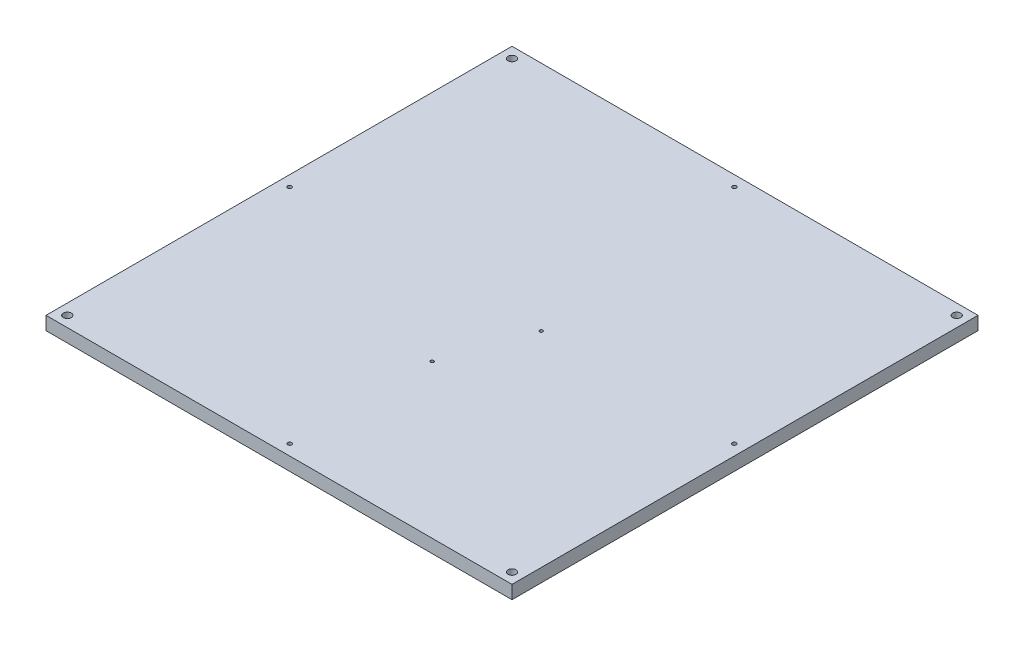
ISO-10303-21;
HEADER;
FILE_DESCRIPTION(('STEP AP214'),'2;1');
FILE_NAME('part.step','',(''),(''),'','','');
FILE_SCHEMA(('AUTOMOTIVE_DESIGN { 1 0 10303 214 1 1 1 1 }'));
ENDSEC;
DATA;
#1=APPLICATION_CONTEXT('core data for automotive mechanical design processes');
#2=APPLICATION_PROTOCOL_DEFINITION('international standard','automotive_design',2000,#1);
#3=PRODUCT_CONTEXT('',#1,'mechanical');
#4=PRODUCT('Part','Part','',(#3));
#5=PRODUCT_RELATED_PRODUCT_CATEGORY('part','',(#4));
#6=PRODUCT_DEFINITION_FORMATION('','',#4);
#7=PRODUCT_DEFINITION_CONTEXT('part definition',#1,'design');
#8=PRODUCT_DEFINITION('design','',#6,#7);
#9=PRODUCT_DEFINITION_SHAPE('','',#8);
#10=(LENGTH_UNIT() NAMED_UNIT(*) SI_UNIT(.MILLI.,.METRE.));
#11=(NAMED_UNIT(*) PLANE_ANGLE_UNIT() SI_UNIT($,.RADIAN.));
#12=(NAMED_UNIT(*) SI_UNIT($,.STERADIAN.) SOLID_ANGLE_UNIT());
#13=UNCERTAINTY_MEASURE_WITH_UNIT(LENGTH_MEASURE(1.E-05),#10,'distance_accuracy_value','');
#14=(GEOMETRIC_REPRESENTATION_CONTEXT(3) GLOBAL_UNCERTAINTY_ASSIGNED_CONTEXT((#13)) GLOBAL_UNIT_ASSIGNED_CONTEXT((#10,
#11,#12)) REPRESENTATION_CONTEXT('',''));
#15=CARTESIAN_POINT('',(0.,0.,0.));
#16=DIRECTION('',(0.,0.,1.));
#17=DIRECTION('',(1.,0.,0.));
#18=AXIS2_PLACEMENT_3D('',#15,#16,#17);
#19=CARTESIAN_POINT('',(0.,-50.,0.));
#20=DIRECTION('',(0.,-1.,0.));
#21=DIRECTION('',(0.,0.,-1.));
#22=AXIS2_PLACEMENT_3D('',#19,#20,#21);
#23=PLANE('',#22);
#24=DIRECTION('',(-1.,0.,0.));
#25=VECTOR('',#24,1.);
#26=CARTESIAN_POINT('',(-1000.,-50.,-1000.));
#27=LINE('',#26,#25);
#28=CARTESIAN_POINT('',(875.,-50.,-1000.));
#29=VERTEX_POINT('',#28);
#30=CARTESIAN_POINT('',(-875.,-50.,-1000.));
#31=VERTEX_POINT('',#30);
#32=EDGE_CURVE('E11',#29,#31,#27,.T.);
#33=ORIENTED_EDGE('',*,*,#32,.F.);
#34=DIRECTION('',(0.,0.,-1.));
#35=VECTOR('',#34,1.);
#36=CARTESIAN_POINT('',(875.,-50.,750.));
#37=LINE('',#36,#35);
#38=CARTESIAN_POINT('',(875.,-50.,750.));
#39=VERTEX_POINT('',#38);
#40=EDGE_CURVE('E82',#39,#29,#37,.T.);
#41=ORIENTED_EDGE('',*,*,#40,.F.);
#42=DIRECTION('',(1.,0.,0.));
#43=VECTOR('',#42,1.);
#44=CARTESIAN_POINT('',(-1000.,-50.,750.));
#45=LINE('',#44,#43);
#46=CARTESIAN_POINT('',(-875.,-50.,750.));
#47=VERTEX_POINT('',#46);
#48=EDGE_CURVE('E93',#47,#39,#45,.T.);
#49=ORIENTED_EDGE('',*,*,#48,.F.);
#50=DIRECTION('',(0.,0.,1.));
#51=VECTOR('',#50,1.);
#52=CARTESIAN_POINT('',(-875.,-50.,-1000.));
#53=LINE('',#52,#51);
#54=EDGE_CURVE('E63',#31,#47,#53,.T.);
#55=ORIENTED_EDGE('',*,*,#54,.F.);
#56=EDGE_LOOP('',(#33,#41,#49,#55));
#57=FACE_BOUND('',#56,.T.);
#58=ADVANCED_FACE('F39',(#57),#23,.T.);
#59=CARTESIAN_POINT('',(0.,0.,0.));
#60=DIRECTION('',(0.,-1.,0.));
#61=DIRECTION('',(0.,0.,-1.));
#62=AXIS2_PLACEMENT_3D('',#59,#60,#61);
#63=PLANE('',#62);
#64=CARTESIAN_POINT('',(835.,0.,-125.));
#65=DIRECTION('',(0.,1.,0.));
#66=DIRECTION('',(0.,0.,1.));
#67=AXIS2_PLACEMENT_3D('',#64,#65,#66);
#68=CIRCLE('',#67,7.49999999999995);
#69=CARTESIAN_POINT('',(835.,0.,-117.5));
#70=VERTEX_POINT('',#69);
#71=EDGE_CURVE('E359',#70,#70,#68,.T.);
#72=ORIENTED_EDGE('',*,*,#71,.F.);
#73=EDGE_LOOP('',(#72));
#74=FACE_BOUND('',#73,.T.);
#75=CARTESIAN_POINT('',(-835.,0.,-960.));
#76=DIRECTION('',(0.,1.,0.));
#77=DIRECTION('',(0.,0.,1.));
#78=AXIS2_PLACEMENT_3D('',#75,#76,#77);
#79=CIRCLE('',#78,15.);
#80=CARTESIAN_POINT('',(-835.,0.,-945.));
#81=VERTEX_POINT('',#80);
#82=EDGE_CURVE('E358',#81,#81,#79,.T.);
#83=ORIENTED_EDGE('',*,*,#82,.F.);
#84=EDGE_LOOP('',(#83));
#85=FACE_BOUND('',#84,.T.);
#86=CARTESIAN_POINT('',(835.,0.,710.));
#87=DIRECTION('',(0.,1.,0.));
#88=DIRECTION('',(0.,0.,1.));
#89=AXIS2_PLACEMENT_3D('',#86,#87,#88);
#90=CIRCLE('',#89,15.);
#91=CARTESIAN_POINT('',(835.,0.,725.));
#92=VERTEX_POINT('',#91);
#93=EDGE_CURVE('E384',#92,#92,#90,.T.);
#94=ORIENTED_EDGE('',*,*,#93,.F.);
#95=EDGE_LOOP('',(#94));
#96=FACE_BOUND('',#95,.T.);
#97=CARTESIAN_POINT('',(835.,0.,-960.));
#98=DIRECTION('',(0.,1.,0.));
#99=DIRECTION('',(0.,0.,1.));
#100=AXIS2_PLACEMENT_3D('',#97,#98,#99);
#101=CIRCLE('',#100,15.);
#102=CARTESIAN_POINT('',(835.,0.,-945.));
#103=VERTEX_POINT('',#102);
#104=EDGE_CURVE('E376',#103,#103,#101,.T.);
#105=ORIENTED_EDGE('',*,*,#104,.F.);
#106=EDGE_LOOP('',(#105));
#107=FACE_BOUND('',#106,.T.);
#108=CARTESIAN_POINT('',(0.,0.,-960.));
#109=DIRECTION('',(0.,1.,0.));
#110=DIRECTION('',(0.,0.,1.));
#111=AXIS2_PLACEMENT_3D('',#108,#109,#110);
#112=CIRCLE('',#111,7.49999999999996);
#113=CARTESIAN_POINT('',(0.,0.,-952.5));
#114=VERTEX_POINT('',#113);
#115=EDGE_CURVE('E414',#114,#114,#112,.T.);
#116=ORIENTED_EDGE('',*,*,#115,.F.);
#117=EDGE_LOOP('',(#116));
#118=FACE_BOUND('',#117,.T.);
#119=CARTESIAN_POINT('',(0.,0.,710.));
#120=DIRECTION('',(0.,1.,0.));
#121=DIRECTION('',(0.,0.,1.));
#122=AXIS2_PLACEMENT_3D('',#119,#120,#121);
#123=CIRCLE('',#122,7.5);
#124=CARTESIAN_POINT('',(0.,0.,717.5));
#125=VERTEX_POINT('',#124);
#126=EDGE_CURVE('E406',#125,#125,#123,.T.);
#127=ORIENTED_EDGE('',*,*,#126,.F.);
#128=EDGE_LOOP('',(#127));
#129=FACE_BOUND('',#128,.T.);
#130=CARTESIAN_POINT('',(-835.,0.,-125.));
#131=DIRECTION('',(0.,1.,0.));
#132=DIRECTION('',(0.,0.,1.));
#133=AXIS2_PLACEMENT_3D('',#130,#131,#132);
#134=CIRCLE('',#133,7.49999999999995);
#135=CARTESIAN_POINT('',(-835.,0.,-117.5));
#136=VERTEX_POINT('',#135);
#137=EDGE_CURVE('E398',#136,#136,#134,.T.);
#138=ORIENTED_EDGE('',*,*,#137,.F.);
#139=EDGE_LOOP('',(#138));
#140=FACE_BOUND('',#139,.T.);
#141=CARTESIAN_POINT('',(-835.,0.,710.));
#142=DIRECTION('',(0.,1.,0.));
#143=DIRECTION('',(0.,0.,1.));
#144=AXIS2_PLACEMENT_3D('',#141,#142,#143);
#145=CIRCLE('',#144,15.);
#146=CARTESIAN_POINT('',(-835.,0.,725.));
#147=VERTEX_POINT('',#146);
#148=EDGE_CURVE('E375',#147,#147,#145,.T.);
#149=ORIENTED_EDGE('',*,*,#148,.F.);
#150=EDGE_LOOP('',(#149));
#151=FACE_BOUND('',#150,.T.);
#152=CARTESIAN_POINT('',(0.,0.,175.));
#153=DIRECTION('',(0.,1.,0.));
#154=DIRECTION('',(0.,0.,1.));
#155=AXIS2_PLACEMENT_3D('',#152,#153,#154);
#156=CIRCLE('',#155,6.);
#157=CARTESIAN_POINT('',(0.,0.,181.));
#158=VERTEX_POINT('',#157);
#159=EDGE_CURVE('E105',#158,#158,#156,.T.);
#160=ORIENTED_EDGE('',*,*,#159,.F.);
#161=EDGE_LOOP('',(#160));
#162=FACE_BOUND('',#161,.T.);
#163=CARTESIAN_POINT('',(106.,0.,-129.));
#164=DIRECTION('',(0.,1.,0.));
#165=DIRECTION('',(0.,0.,1.));
#166=AXIS2_PLACEMENT_3D('',#163,#164,#165);
#167=CIRCLE('',#166,6.00000000000002);
#168=CARTESIAN_POINT('',(106.,0.,-123.));
#169=VERTEX_POINT('',#168);
#170=EDGE_CURVE('E115',#169,#169,#167,.T.);
#171=ORIENTED_EDGE('',*,*,#170,.F.);
#172=EDGE_LOOP('',(#171));
#173=FACE_BOUND('',#172,.T.);
#174=DIRECTION('',(0.,0.,1.));
#175=VECTOR('',#174,1.);
#176=CARTESIAN_POINT('',(875.,0.,750.));
#177=LINE('',#176,#175);
#178=CARTESIAN_POINT('',(875.,0.,-1000.));
#179=VERTEX_POINT('',#178);
#180=CARTESIAN_POINT('',(875.,0.,750.));
#181=VERTEX_POINT('',#180);
#182=EDGE_CURVE('E55',#179,#181,#177,.T.);
#183=ORIENTED_EDGE('',*,*,#182,.F.);
#184=DIRECTION('',(-1.,0.,0.));
#185=VECTOR('',#184,1.);
#186=CARTESIAN_POINT('',(-1000.,0.,-1000.));
#187=LINE('',#186,#185);
#188=CARTESIAN_POINT('',(-875.,0.,-1000.));
#189=VERTEX_POINT('',#188);
#190=EDGE_CURVE('E43',#179,#189,#187,.T.);
#191=ORIENTED_EDGE('',*,*,#190,.T.);
#192=DIRECTION('',(0.,0.,-1.));
#193=VECTOR('',#192,1.);
#194=CARTESIAN_POINT('',(-875.,0.,-1000.));
#195=LINE('',#194,#193);
#196=CARTESIAN_POINT('',(-875.,0.,750.));
#197=VERTEX_POINT('',#196);
#198=EDGE_CURVE('E101',#197,#189,#195,.T.);
#199=ORIENTED_EDGE('',*,*,#198,.F.);
#200=DIRECTION('',(-1.,0.,0.));
#201=VECTOR('',#200,1.);
#202=CARTESIAN_POINT('',(-1000.,0.,750.));
#203=LINE('',#202,#201);
#204=EDGE_CURVE('E100',#181,#197,#203,.T.);
#205=ORIENTED_EDGE('',*,*,#204,.F.);
#206=EDGE_LOOP('',(#183,#191,#199,#205));
#207=FACE_BOUND('',#206,.T.);
#208=ADVANCED_FACE('F129',(#74,#85,#96,#107,#118,#129,#140,#151,#162,#173,#207),#63,.F.);
#209=CARTESIAN_POINT('',(-1000.,-50.,-1000.));
#210=DIRECTION('',(0.,0.,-1.));
#211=DIRECTION('',(-1.,0.,0.));
#212=AXIS2_PLACEMENT_3D('',#209,#210,#211);
#213=PLANE('',#212);
#214=ORIENTED_EDGE('',*,*,#190,.F.);
#215=DIRECTION('',(0.,1.,0.));
#216=VECTOR('',#215,1.);
#217=CARTESIAN_POINT('',(875.,0.,-1000.));
#218=LINE('',#217,#216);
#219=EDGE_CURVE('E95',#29,#179,#218,.T.);
#220=ORIENTED_EDGE('',*,*,#219,.F.);
#221=ORIENTED_EDGE('',*,*,#32,.T.);
#222=DIRECTION('',(0.,-1.,0.));
#223=VECTOR('',#222,1.);
#224=CARTESIAN_POINT('',(-875.,0.,-1000.));
#225=LINE('',#224,#223);
#226=EDGE_CURVE('E138',#189,#31,#225,.T.);
#227=ORIENTED_EDGE('',*,*,#226,.F.);
#228=EDGE_LOOP('',(#214,#220,#221,#227));
#229=FACE_BOUND('',#228,.T.);
#230=ADVANCED_FACE('F41',(#229),#213,.T.);
#231=CARTESIAN_POINT('',(0.,0.,750.));
#232=DIRECTION('',(0.,0.,1.));
#233=DIRECTION('',(1.,0.,0.));
#234=AXIS2_PLACEMENT_3D('',#231,#232,#233);
#235=PLANE('',#234);
#236=ORIENTED_EDGE('',*,*,#48,.T.);
#237=DIRECTION('',(0.,-1.,0.));
#238=VECTOR('',#237,1.);
#239=CARTESIAN_POINT('',(875.,0.,750.));
#240=LINE('',#239,#238);
#241=EDGE_CURVE('E79',#181,#39,#240,.T.);
#242=ORIENTED_EDGE('',*,*,#241,.F.);
#243=ORIENTED_EDGE('',*,*,#204,.T.);
#244=DIRECTION('',(0.,1.,0.));
#245=VECTOR('',#244,1.);
#246=CARTESIAN_POINT('',(-875.,0.,750.));
#247=LINE('',#246,#245);
#248=EDGE_CURVE('E98',#47,#197,#247,.T.);
#249=ORIENTED_EDGE('',*,*,#248,.F.);
#250=EDGE_LOOP('',(#236,#242,#243,#249));
#251=FACE_BOUND('',#250,.T.);
#252=ADVANCED_FACE('F97',(#251),#235,.T.);
#253=CARTESIAN_POINT('',(0.,-30.,175.));
#254=DIRECTION('',(0.,1.,0.));
#255=DIRECTION('',(0.,0.,1.));
#256=AXIS2_PLACEMENT_3D('',#253,#254,#255);
#257=CYLINDRICAL_SURFACE('',#256,6.);
#258=CARTESIAN_POINT('',(0.,-30.,175.));
#259=DIRECTION('',(0.,1.,0.));
#260=DIRECTION('',(0.,0.,1.));
#261=AXIS2_PLACEMENT_3D('',#258,#259,#260);
#262=CIRCLE('',#261,6.);
#263=CARTESIAN_POINT('',(0.,-30.,181.));
#264=VERTEX_POINT('',#263);
#265=EDGE_CURVE('E119',#264,#264,#262,.T.);
#266=ORIENTED_EDGE('',*,*,#265,.F.);
#267=EDGE_LOOP('',(#266));
#268=FACE_BOUND('',#267,.T.);
#269=ORIENTED_EDGE('',*,*,#159,.T.);
#270=EDGE_LOOP('',(#269));
#271=FACE_BOUND('',#270,.T.);
#272=ADVANCED_FACE('F127',(#268,#271),#257,.F.);
#273=CARTESIAN_POINT('',(0.,-30.,175.));
#274=DIRECTION('',(0.,1.,0.));
#275=DIRECTION('',(0.,0.,1.));
#276=AXIS2_PLACEMENT_3D('',#273,#274,#275);
#277=PLANE('',#276);
#278=ORIENTED_EDGE('',*,*,#265,.T.);
#279=EDGE_LOOP('',(#278));
#280=FACE_BOUND('',#279,.T.);
#281=ADVANCED_FACE('F170',(#280),#277,.T.);
#282=CARTESIAN_POINT('',(106.,-30.,-129.));
#283=DIRECTION('',(0.,1.,0.));
#284=DIRECTION('',(0.,0.,1.));
#285=AXIS2_PLACEMENT_3D('',#282,#283,#284);
#286=CYLINDRICAL_SURFACE('',#285,6.00000000000002);
#287=CARTESIAN_POINT('',(106.,-30.,-129.));
#288=DIRECTION('',(0.,1.,0.));
#289=DIRECTION('',(0.,0.,1.));
#290=AXIS2_PLACEMENT_3D('',#287,#288,#289);
#291=CIRCLE('',#290,6.00000000000002);
#292=CARTESIAN_POINT('',(106.,-30.,-123.));
#293=VERTEX_POINT('',#292);
#294=EDGE_CURVE('E111',#293,#293,#291,.T.);
#295=ORIENTED_EDGE('',*,*,#294,.F.);
#296=EDGE_LOOP('',(#295));
#297=FACE_BOUND('',#296,.T.);
#298=ORIENTED_EDGE('',*,*,#170,.T.);
#299=EDGE_LOOP('',(#298));
#300=FACE_BOUND('',#299,.T.);
#301=ADVANCED_FACE('F159',(#297,#300),#286,.F.);
#302=CARTESIAN_POINT('',(106.,-30.,-129.));
#303=DIRECTION('',(0.,1.,0.));
#304=DIRECTION('',(0.,0.,1.));
#305=AXIS2_PLACEMENT_3D('',#302,#303,#304);
#306=PLANE('',#305);
#307=ORIENTED_EDGE('',*,*,#294,.T.);
#308=EDGE_LOOP('',(#307));
#309=FACE_BOUND('',#308,.T.);
#310=ADVANCED_FACE('F151',(#309),#306,.T.);
#311=CARTESIAN_POINT('',(-875.,0.,0.));
#312=DIRECTION('',(-1.,0.,0.));
#313=DIRECTION('',(0.,0.,1.));
#314=AXIS2_PLACEMENT_3D('',#311,#312,#313);
#315=PLANE('',#314);
#316=ORIENTED_EDGE('',*,*,#226,.T.);
#317=ORIENTED_EDGE('',*,*,#54,.T.);
#318=ORIENTED_EDGE('',*,*,#248,.T.);
#319=ORIENTED_EDGE('',*,*,#198,.T.);
#320=EDGE_LOOP('',(#316,#317,#318,#319));
#321=FACE_BOUND('',#320,.T.);
#322=ADVANCED_FACE('F149',(#321),#315,.T.);
#323=CARTESIAN_POINT('',(875.,0.,0.));
#324=DIRECTION('',(1.,0.,0.));
#325=DIRECTION('',(0.,0.,-1.));
#326=AXIS2_PLACEMENT_3D('',#323,#324,#325);
#327=PLANE('',#326);
#328=ORIENTED_EDGE('',*,*,#241,.T.);
#329=ORIENTED_EDGE('',*,*,#40,.T.);
#330=ORIENTED_EDGE('',*,*,#219,.T.);
#331=ORIENTED_EDGE('',*,*,#182,.T.);
#332=EDGE_LOOP('',(#328,#329,#330,#331));
#333=FACE_BOUND('',#332,.T.);
#334=ADVANCED_FACE('F81',(#333),#327,.T.);
#335=CARTESIAN_POINT('',(-835.,-25.,710.));
#336=DIRECTION('',(0.,1.,0.));
#337=DIRECTION('',(0.,0.,1.));
#338=AXIS2_PLACEMENT_3D('',#335,#336,#337);
#339=CYLINDRICAL_SURFACE('',#338,15.);
#340=CARTESIAN_POINT('',(-835.,-25.,710.));
#341=DIRECTION('',(0.,1.,0.));
#342=DIRECTION('',(0.,0.,1.));
#343=AXIS2_PLACEMENT_3D('',#340,#341,#342);
#344=CIRCLE('',#343,15.);
#345=CARTESIAN_POINT('',(-835.,-25.,725.));
#346=VERTEX_POINT('',#345);
#347=EDGE_CURVE('E88',#346,#346,#344,.T.);
#348=ORIENTED_EDGE('',*,*,#347,.F.);
#349=EDGE_LOOP('',(#348));
#350=FACE_BOUND('',#349,.T.);
#351=ORIENTED_EDGE('',*,*,#148,.T.);
#352=EDGE_LOOP('',(#351));
#353=FACE_BOUND('',#352,.T.);
#354=ADVANCED_FACE('F157',(#350,#353),#339,.F.);
#355=CARTESIAN_POINT('',(-835.,-25.,710.));
#356=DIRECTION('',(0.,1.,0.));
#357=DIRECTION('',(0.,0.,1.));
#358=AXIS2_PLACEMENT_3D('',#355,#356,#357);
#359=PLANE('',#358);
#360=ORIENTED_EDGE('',*,*,#347,.T.);
#361=EDGE_LOOP('',(#360));
#362=FACE_BOUND('',#361,.T.);
#363=ADVANCED_FACE('F200',(#362),#359,.T.);
#364=CARTESIAN_POINT('',(-835.,-25.,-125.));
#365=DIRECTION('',(0.,1.,0.));
#366=DIRECTION('',(0.,0.,1.));
#367=AXIS2_PLACEMENT_3D('',#364,#365,#366);
#368=CYLINDRICAL_SURFACE('',#367,7.49999999999995);
#369=CARTESIAN_POINT('',(-835.,-25.,-125.));
#370=DIRECTION('',(0.,1.,0.));
#371=DIRECTION('',(0.,0.,1.));
#372=AXIS2_PLACEMENT_3D('',#369,#370,#371);
#373=CIRCLE('',#372,7.49999999999995);
#374=CARTESIAN_POINT('',(-835.,-25.,-117.5));
#375=VERTEX_POINT('',#374);
#376=EDGE_CURVE('E402',#375,#375,#373,.T.);
#377=ORIENTED_EDGE('',*,*,#376,.F.);
#378=EDGE_LOOP('',(#377));
#379=FACE_BOUND('',#378,.T.);
#380=ORIENTED_EDGE('',*,*,#137,.T.);
#381=EDGE_LOOP('',(#380));
#382=FACE_BOUND('',#381,.T.);
#383=ADVANCED_FACE('F210',(#379,#382),#368,.F.);
#384=CARTESIAN_POINT('',(-835.,-25.,-125.));
#385=DIRECTION('',(0.,1.,0.));
#386=DIRECTION('',(0.,0.,1.));
#387=AXIS2_PLACEMENT_3D('',#384,#385,#386);
#388=PLANE('',#387);
#389=ORIENTED_EDGE('',*,*,#376,.T.);
#390=EDGE_LOOP('',(#389));
#391=FACE_BOUND('',#390,.T.);
#392=ADVANCED_FACE('F220',(#391),#388,.T.);
#393=CARTESIAN_POINT('',(0.,-25.,710.));
#394=DIRECTION('',(0.,1.,0.));
#395=DIRECTION('',(0.,0.,1.));
#396=AXIS2_PLACEMENT_3D('',#393,#394,#395);
#397=CYLINDRICAL_SURFACE('',#396,7.5);
#398=CARTESIAN_POINT('',(0.,-25.,710.));
#399=DIRECTION('',(0.,1.,0.));
#400=DIRECTION('',(0.,0.,1.));
#401=AXIS2_PLACEMENT_3D('',#398,#399,#400);
#402=CIRCLE('',#401,7.5);
#403=CARTESIAN_POINT('',(0.,-25.,717.5));
#404=VERTEX_POINT('',#403);
#405=EDGE_CURVE('E410',#404,#404,#402,.T.);
#406=ORIENTED_EDGE('',*,*,#405,.F.);
#407=EDGE_LOOP('',(#406));
#408=FACE_BOUND('',#407,.T.);
#409=ORIENTED_EDGE('',*,*,#126,.T.);
#410=EDGE_LOOP('',(#409));
#411=FACE_BOUND('',#410,.T.);
#412=ADVANCED_FACE('F230',(#408,#411),#397,.F.);
#413=CARTESIAN_POINT('',(0.,-25.,710.));
#414=DIRECTION('',(0.,1.,0.));
#415=DIRECTION('',(0.,0.,1.));
#416=AXIS2_PLACEMENT_3D('',#413,#414,#415);
#417=PLANE('',#416);
#418=ORIENTED_EDGE('',*,*,#405,.T.);
#419=EDGE_LOOP('',(#418));
#420=FACE_BOUND('',#419,.T.);
#421=ADVANCED_FACE('F240',(#420),#417,.T.);
#422=CARTESIAN_POINT('',(0.,-25.,-960.));
#423=DIRECTION('',(0.,1.,0.));
#424=DIRECTION('',(0.,0.,1.));
#425=AXIS2_PLACEMENT_3D('',#422,#423,#424);
#426=CYLINDRICAL_SURFACE('',#425,7.49999999999996);
#427=CARTESIAN_POINT('',(0.,-25.,-960.));
#428=DIRECTION('',(0.,1.,0.));
#429=DIRECTION('',(0.,0.,1.));
#430=AXIS2_PLACEMENT_3D('',#427,#428,#429);
#431=CIRCLE('',#430,7.49999999999996);
#432=CARTESIAN_POINT('',(0.,-25.,-952.5));
#433=VERTEX_POINT('',#432);
#434=EDGE_CURVE('E367',#433,#433,#431,.T.);
#435=ORIENTED_EDGE('',*,*,#434,.F.);
#436=EDGE_LOOP('',(#435));
#437=FACE_BOUND('',#436,.T.);
#438=ORIENTED_EDGE('',*,*,#115,.T.);
#439=EDGE_LOOP('',(#438));
#440=FACE_BOUND('',#439,.T.);
#441=ADVANCED_FACE('F250',(#437,#440),#426,.F.);
#442=CARTESIAN_POINT('',(0.,-25.,-960.));
#443=DIRECTION('',(0.,1.,0.));
#444=DIRECTION('',(0.,0.,1.));
#445=AXIS2_PLACEMENT_3D('',#442,#443,#444);
#446=PLANE('',#445);
#447=ORIENTED_EDGE('',*,*,#434,.T.);
#448=EDGE_LOOP('',(#447));
#449=FACE_BOUND('',#448,.T.);
#450=ADVANCED_FACE('F260',(#449),#446,.T.);
#451=CARTESIAN_POINT('',(835.,-25.,-960.));
#452=DIRECTION('',(0.,1.,0.));
#453=DIRECTION('',(0.,0.,1.));
#454=AXIS2_PLACEMENT_3D('',#451,#452,#453);
#455=CYLINDRICAL_SURFACE('',#454,15.);
#456=CARTESIAN_POINT('',(835.,-25.,-960.));
#457=DIRECTION('',(0.,1.,0.));
#458=DIRECTION('',(0.,0.,1.));
#459=AXIS2_PLACEMENT_3D('',#456,#457,#458);
#460=CIRCLE('',#459,15.);
#461=CARTESIAN_POINT('',(835.,-25.,-945.));
#462=VERTEX_POINT('',#461);
#463=EDGE_CURVE('E371',#462,#462,#460,.T.);
#464=ORIENTED_EDGE('',*,*,#463,.F.);
#465=EDGE_LOOP('',(#464));
#466=FACE_BOUND('',#465,.T.);
#467=ORIENTED_EDGE('',*,*,#104,.T.);
#468=EDGE_LOOP('',(#467));
#469=FACE_BOUND('',#468,.T.);
#470=ADVANCED_FACE('F270',(#466,#469),#455,.F.);
#471=CARTESIAN_POINT('',(835.,-25.,-960.));
#472=DIRECTION('',(0.,1.,0.));
#473=DIRECTION('',(0.,0.,1.));
#474=AXIS2_PLACEMENT_3D('',#471,#472,#473);
#475=PLANE('',#474);
#476=ORIENTED_EDGE('',*,*,#463,.T.);
#477=EDGE_LOOP('',(#476));
#478=FACE_BOUND('',#477,.T.);
#479=ADVANCED_FACE('F280',(#478),#475,.T.);
#480=CARTESIAN_POINT('',(835.,-25.,710.));
#481=DIRECTION('',(0.,1.,0.));
#482=DIRECTION('',(0.,0.,1.));
#483=AXIS2_PLACEMENT_3D('',#480,#481,#482);
#484=CYLINDRICAL_SURFACE('',#483,15.);
#485=CARTESIAN_POINT('',(835.,-25.,710.));
#486=DIRECTION('',(0.,1.,0.));
#487=DIRECTION('',(0.,0.,1.));
#488=AXIS2_PLACEMENT_3D('',#485,#486,#487);
#489=CIRCLE('',#488,15.);
#490=CARTESIAN_POINT('',(835.,-25.,725.));
#491=VERTEX_POINT('',#490);
#492=EDGE_CURVE('E380',#491,#491,#489,.T.);
#493=ORIENTED_EDGE('',*,*,#492,.F.);
#494=EDGE_LOOP('',(#493));
#495=FACE_BOUND('',#494,.T.);
#496=ORIENTED_EDGE('',*,*,#93,.T.);
#497=EDGE_LOOP('',(#496));
#498=FACE_BOUND('',#497,.T.);
#499=ADVANCED_FACE('F290',(#495,#498),#484,.F.);
#500=CARTESIAN_POINT('',(835.,-25.,710.));
#501=DIRECTION('',(0.,1.,0.));
#502=DIRECTION('',(0.,0.,1.));
#503=AXIS2_PLACEMENT_3D('',#500,#501,#502);
#504=PLANE('',#503);
#505=ORIENTED_EDGE('',*,*,#492,.T.);
#506=EDGE_LOOP('',(#505));
#507=FACE_BOUND('',#506,.T.);
#508=ADVANCED_FACE('F300',(#507),#504,.T.);
#509=CARTESIAN_POINT('',(-835.,-25.,-960.));
#510=DIRECTION('',(0.,1.,0.));
#511=DIRECTION('',(0.,0.,1.));
#512=AXIS2_PLACEMENT_3D('',#509,#510,#511);
#513=CYLINDRICAL_SURFACE('',#512,15.);
#514=CARTESIAN_POINT('',(-835.,-25.,-960.));
#515=DIRECTION('',(0.,1.,0.));
#516=DIRECTION('',(0.,0.,1.));
#517=AXIS2_PLACEMENT_3D('',#514,#515,#516);
#518=CIRCLE('',#517,15.);
#519=CARTESIAN_POINT('',(-835.,-25.,-945.));
#520=VERTEX_POINT('',#519);
#521=EDGE_CURVE('E364',#520,#520,#518,.T.);
#522=ORIENTED_EDGE('',*,*,#521,.F.);
#523=EDGE_LOOP('',(#522));
#524=FACE_BOUND('',#523,.T.);
#525=ORIENTED_EDGE('',*,*,#82,.T.);
#526=EDGE_LOOP('',(#525));
#527=FACE_BOUND('',#526,.T.);
#528=ADVANCED_FACE('F310',(#524,#527),#513,.F.);
#529=CARTESIAN_POINT('',(-835.,-25.,-960.));
#530=DIRECTION('',(0.,1.,0.));
#531=DIRECTION('',(0.,0.,1.));
#532=AXIS2_PLACEMENT_3D('',#529,#530,#531);
#533=PLANE('',#532);
#534=ORIENTED_EDGE('',*,*,#521,.T.);
#535=EDGE_LOOP('',(#534));
#536=FACE_BOUND('',#535,.T.);
#537=ADVANCED_FACE('F320',(#536),#533,.T.);
#538=CARTESIAN_POINT('',(835.,-25.,-125.));
#539=DIRECTION('',(0.,1.,0.));
#540=DIRECTION('',(0.,0.,1.));
#541=AXIS2_PLACEMENT_3D('',#538,#539,#540);
#542=CYLINDRICAL_SURFACE('',#541,7.49999999999995);
#543=CARTESIAN_POINT('',(835.,-25.,-125.));
#544=DIRECTION('',(0.,1.,0.));
#545=DIRECTION('',(0.,0.,1.));
#546=AXIS2_PLACEMENT_3D('',#543,#544,#545);
#547=CIRCLE('',#546,7.49999999999995);
#548=CARTESIAN_POINT('',(835.,-25.,-117.5));
#549=VERTEX_POINT('',#548);
#550=EDGE_CURVE('E356',#549,#549,#547,.T.);
#551=ORIENTED_EDGE('',*,*,#550,.F.);
#552=EDGE_LOOP('',(#551));
#553=FACE_BOUND('',#552,.T.);
#554=ORIENTED_EDGE('',*,*,#71,.T.);
#555=EDGE_LOOP('',(#554));
#556=FACE_BOUND('',#555,.T.);
#557=ADVANCED_FACE('F330',(#553,#556),#542,.F.);
#558=CARTESIAN_POINT('',(835.,-25.,-125.));
#559=DIRECTION('',(0.,1.,0.));
#560=DIRECTION('',(0.,0.,1.));
#561=AXIS2_PLACEMENT_3D('',#558,#559,#560);
#562=PLANE('',#561);
#563=ORIENTED_EDGE('',*,*,#550,.T.);
#564=EDGE_LOOP('',(#563));
#565=FACE_BOUND('',#564,.T.);
#566=ADVANCED_FACE('F340',(#565),#562,.T.);
#567=CLOSED_SHELL('',(#58,#208,#230,#252,#272,#281,#301,#310,#322,#334,#354,#363,#383,#392,#412,
#421,#441,#450,#470,#479,#499,#508,#528,#537,#557,#566));
#568=MANIFOLD_SOLID_BREP('B2',#567);
#569=ADVANCED_BREP_SHAPE_REPRESENTATION('',(#18,#568),#14);
#570=SHAPE_DEFINITION_REPRESENTATION(#9,#569);
ENDSEC;
END-ISO-10303-21;
